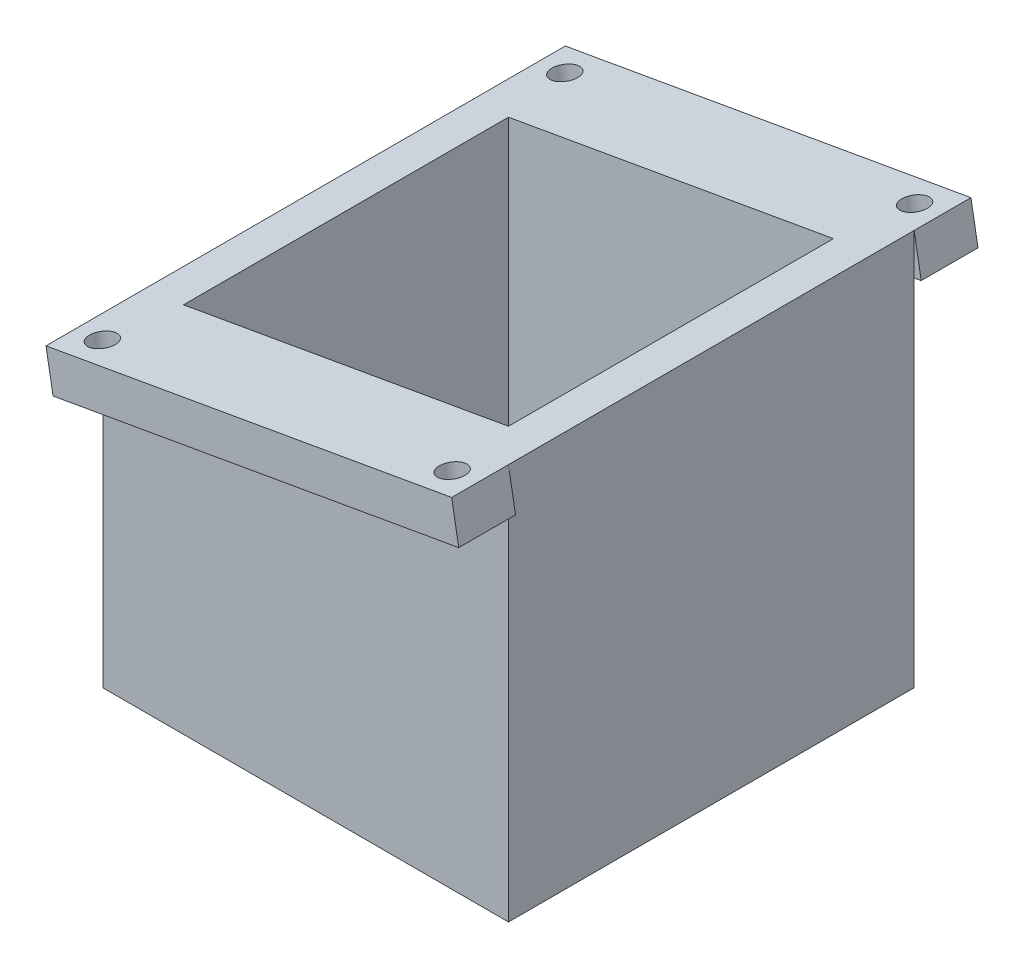
ISO-10303-21;
HEADER;
FILE_DESCRIPTION(('STEP AP214'),'2;1');
FILE_NAME('part.step','',(''),(''),'','','');
FILE_SCHEMA(('AUTOMOTIVE_DESIGN { 1 0 10303 214 1 1 1 1 }'));
ENDSEC;
DATA;
#1=APPLICATION_CONTEXT('core data for automotive mechanical design processes');
#2=APPLICATION_PROTOCOL_DEFINITION('international standard','automotive_design',2000,#1);
#3=PRODUCT_CONTEXT('',#1,'mechanical');
#4=PRODUCT('Part','Part','',(#3));
#5=PRODUCT_RELATED_PRODUCT_CATEGORY('part','',(#4));
#6=PRODUCT_DEFINITION_FORMATION('','',#4);
#7=PRODUCT_DEFINITION_CONTEXT('part definition',#1,'design');
#8=PRODUCT_DEFINITION('design','',#6,#7);
#9=PRODUCT_DEFINITION_SHAPE('','',#8);
#10=(LENGTH_UNIT() NAMED_UNIT(*) SI_UNIT(.MILLI.,.METRE.));
#11=(NAMED_UNIT(*) PLANE_ANGLE_UNIT() SI_UNIT($,.RADIAN.));
#12=(NAMED_UNIT(*) SI_UNIT($,.STERADIAN.) SOLID_ANGLE_UNIT());
#13=UNCERTAINTY_MEASURE_WITH_UNIT(LENGTH_MEASURE(1.E-05),#10,'distance_accuracy_value','');
#14=(GEOMETRIC_REPRESENTATION_CONTEXT(3) GLOBAL_UNCERTAINTY_ASSIGNED_CONTEXT((#13)) GLOBAL_UNIT_ASSIGNED_CONTEXT((#10,
#11,#12)) REPRESENTATION_CONTEXT('',''));
#15=CARTESIAN_POINT('',(0.,0.,0.));
#16=DIRECTION('',(0.,0.,1.));
#17=DIRECTION('',(1.,0.,0.));
#18=AXIS2_PLACEMENT_3D('',#15,#16,#17);
#19=CARTESIAN_POINT('',(25.,5.,-25.));
#20=DIRECTION('',(0.,0.,1.));
#21=DIRECTION('',(1.,0.,0.));
#22=AXIS2_PLACEMENT_3D('',#19,#20,#21);
#23=PLANE('',#22);
#24=DIRECTION('',(-0.17364819609251,0.984807749763281,0.));
#25=VECTOR('',#24,1.);
#26=CARTESIAN_POINT('',(-24.1317590195375,35.0759612511836,-25.));
#27=LINE('',#26,#25);
#28=CARTESIAN_POINT('',(-24.1317590195375,35.0759612511836,-25.));
#29=VERTEX_POINT('',#28);
#30=CARTESIAN_POINT('',(-25.,40.,-25.));
#31=VERTEX_POINT('',#30);
#32=EDGE_CURVE('E300',#29,#31,#27,.T.);
#33=ORIENTED_EDGE('',*,*,#32,.F.);
#34=DIRECTION('',(0.984807749763281,0.17364819609251,0.));
#35=VECTOR('',#34,1.);
#36=CARTESIAN_POINT('',(-24.1317590195375,35.0759612511836,-25.));
#37=LINE('',#36,#35);
#38=CARTESIAN_POINT('',(25.,43.7392169238216,-25.));
#39=VERTEX_POINT('',#38);
#40=EDGE_CURVE('E291',#29,#39,#37,.T.);
#41=ORIENTED_EDGE('',*,*,#40,.T.);
#42=DIRECTION('',(0.,-1.,0.));
#43=VECTOR('',#42,1.);
#44=CARTESIAN_POINT('',(25.,5.,-25.));
#45=LINE('',#44,#43);
#46=CARTESIAN_POINT('',(25.,0.,-25.));
#47=VERTEX_POINT('',#46);
#48=EDGE_CURVE('E284',#39,#47,#45,.T.);
#49=ORIENTED_EDGE('',*,*,#48,.T.);
#50=DIRECTION('',(-1.,0.,0.));
#51=VECTOR('',#50,1.);
#52=CARTESIAN_POINT('',(25.,0.,-25.));
#53=LINE('',#52,#51);
#54=CARTESIAN_POINT('',(-25.,0.,-25.));
#55=VERTEX_POINT('',#54);
#56=EDGE_CURVE('E279',#47,#55,#53,.T.);
#57=ORIENTED_EDGE('',*,*,#56,.T.);
#58=DIRECTION('',(0.,-1.,0.));
#59=VECTOR('',#58,1.);
#60=CARTESIAN_POINT('',(-25.,5.,-25.));
#61=LINE('',#60,#59);
#62=EDGE_CURVE('E281',#31,#55,#61,.T.);
#63=ORIENTED_EDGE('',*,*,#62,.F.);
#64=EDGE_LOOP('',(#33,#41,#49,#57,#63));
#65=FACE_BOUND('',#64,.T.);
#66=ADVANCED_FACE('F38',(#65),#23,.F.);
#67=CARTESIAN_POINT('',(0.,5.,0.));
#68=DIRECTION('',(0.,-1.,0.));
#69=DIRECTION('',(0.,0.,-1.));
#70=AXIS2_PLACEMENT_3D('',#67,#68,#69);
#71=PLANE('',#70);
#72=DIRECTION('',(0.,0.,-1.));
#73=VECTOR('',#72,1.);
#74=CARTESIAN_POINT('',(20.025,5.,0.));
#75=LINE('',#74,#73);
#76=CARTESIAN_POINT('',(20.025,5.,20.025));
#77=VERTEX_POINT('',#76);
#78=CARTESIAN_POINT('',(20.025,5.,-20.025));
#79=VERTEX_POINT('',#78);
#80=EDGE_CURVE('E234',#77,#79,#75,.T.);
#81=ORIENTED_EDGE('',*,*,#80,.T.);
#82=DIRECTION('',(-1.,0.,0.));
#83=VECTOR('',#82,1.);
#84=CARTESIAN_POINT('',(0.,5.,-20.025));
#85=LINE('',#84,#83);
#86=CARTESIAN_POINT('',(-20.025,5.,-20.025));
#87=VERTEX_POINT('',#86);
#88=EDGE_CURVE('E237',#79,#87,#85,.T.);
#89=ORIENTED_EDGE('',*,*,#88,.T.);
#90=DIRECTION('',(0.,0.,1.));
#91=VECTOR('',#90,1.);
#92=CARTESIAN_POINT('',(-20.025,5.,0.));
#93=LINE('',#92,#91);
#94=CARTESIAN_POINT('',(-20.025,5.,20.025));
#95=VERTEX_POINT('',#94);
#96=EDGE_CURVE('E228',#87,#95,#93,.T.);
#97=ORIENTED_EDGE('',*,*,#96,.T.);
#98=DIRECTION('',(1.,0.,0.));
#99=VECTOR('',#98,1.);
#100=CARTESIAN_POINT('',(0.,5.,20.025));
#101=LINE('',#100,#99);
#102=EDGE_CURVE('E231',#95,#77,#101,.T.);
#103=ORIENTED_EDGE('',*,*,#102,.T.);
#104=EDGE_LOOP('',(#81,#89,#97,#103));
#105=FACE_BOUND('',#104,.T.);
#106=DIRECTION('',(0.,0.,1.));
#107=VECTOR('',#106,1.);
#108=CARTESIAN_POINT('',(-18.025,5.,-18.025));
#109=LINE('',#108,#107);
#110=CARTESIAN_POINT('',(-18.025,5.,-18.025));
#111=VERTEX_POINT('',#110);
#112=CARTESIAN_POINT('',(-18.025,5.,18.025));
#113=VERTEX_POINT('',#112);
#114=EDGE_CURVE('E241',#111,#113,#109,.T.);
#115=ORIENTED_EDGE('',*,*,#114,.F.);
#116=DIRECTION('',(-1.,0.,0.));
#117=VECTOR('',#116,1.);
#118=CARTESIAN_POINT('',(18.025,5.,-18.025));
#119=LINE('',#118,#117);
#120=CARTESIAN_POINT('',(18.025,5.,-18.025));
#121=VERTEX_POINT('',#120);
#122=EDGE_CURVE('E249',#121,#111,#119,.T.);
#123=ORIENTED_EDGE('',*,*,#122,.F.);
#124=DIRECTION('',(0.,0.,-1.));
#125=VECTOR('',#124,1.);
#126=CARTESIAN_POINT('',(18.025,5.,-18.025));
#127=LINE('',#126,#125);
#128=CARTESIAN_POINT('',(18.025,5.,18.025));
#129=VERTEX_POINT('',#128);
#130=EDGE_CURVE('E246',#129,#121,#127,.T.);
#131=ORIENTED_EDGE('',*,*,#130,.F.);
#132=DIRECTION('',(1.,0.,0.));
#133=VECTOR('',#132,1.);
#134=CARTESIAN_POINT('',(18.025,5.,18.025));
#135=LINE('',#134,#133);
#136=EDGE_CURVE('E243',#113,#129,#135,.T.);
#137=ORIENTED_EDGE('',*,*,#136,.F.);
#138=EDGE_LOOP('',(#115,#123,#131,#137));
#139=FACE_BOUND('',#138,.T.);
#140=ADVANCED_FACE('F331',(#105,#139),#71,.F.);
#141=CARTESIAN_POINT('',(0.,0.,0.));
#142=DIRECTION('',(0.,-1.,0.));
#143=DIRECTION('',(0.,0.,-1.));
#144=AXIS2_PLACEMENT_3D('',#141,#142,#143);
#145=PLANE('',#144);
#146=DIRECTION('',(-1.,0.,0.));
#147=VECTOR('',#146,1.);
#148=CARTESIAN_POINT('',(18.025,0.,-18.025));
#149=LINE('',#148,#147);
#150=CARTESIAN_POINT('',(18.025,0.,-18.025));
#151=VERTEX_POINT('',#150);
#152=CARTESIAN_POINT('',(-18.025,0.,-18.025));
#153=VERTEX_POINT('',#152);
#154=EDGE_CURVE('E244',#151,#153,#149,.T.);
#155=ORIENTED_EDGE('',*,*,#154,.T.);
#156=DIRECTION('',(0.,0.,1.));
#157=VECTOR('',#156,1.);
#158=CARTESIAN_POINT('',(-18.025,0.,-18.025));
#159=LINE('',#158,#157);
#160=CARTESIAN_POINT('',(-18.025,0.,18.025));
#161=VERTEX_POINT('',#160);
#162=EDGE_CURVE('E240',#153,#161,#159,.T.);
#163=ORIENTED_EDGE('',*,*,#162,.T.);
#164=DIRECTION('',(1.,0.,0.));
#165=VECTOR('',#164,1.);
#166=CARTESIAN_POINT('',(18.025,0.,18.025));
#167=LINE('',#166,#165);
#168=CARTESIAN_POINT('',(18.025,0.,18.025));
#169=VERTEX_POINT('',#168);
#170=EDGE_CURVE('E254',#161,#169,#167,.T.);
#171=ORIENTED_EDGE('',*,*,#170,.T.);
#172=DIRECTION('',(0.,0.,-1.));
#173=VECTOR('',#172,1.);
#174=CARTESIAN_POINT('',(18.025,0.,-18.025));
#175=LINE('',#174,#173);
#176=EDGE_CURVE('E257',#169,#151,#175,.T.);
#177=ORIENTED_EDGE('',*,*,#176,.T.);
#178=EDGE_LOOP('',(#155,#163,#171,#177));
#179=FACE_BOUND('',#178,.T.);
#180=DIRECTION('',(0.,0.,1.));
#181=VECTOR('',#180,1.);
#182=CARTESIAN_POINT('',(-25.,0.,-25.));
#183=LINE('',#182,#181);
#184=CARTESIAN_POINT('',(-25.,0.,25.));
#185=VERTEX_POINT('',#184);
#186=EDGE_CURVE('E271',#55,#185,#183,.T.);
#187=ORIENTED_EDGE('',*,*,#186,.F.);
#188=ORIENTED_EDGE('',*,*,#56,.F.);
#189=DIRECTION('',(0.,0.,-1.));
#190=VECTOR('',#189,1.);
#191=CARTESIAN_POINT('',(25.,0.,-25.));
#192=LINE('',#191,#190);
#193=CARTESIAN_POINT('',(25.,0.,25.));
#194=VERTEX_POINT('',#193);
#195=EDGE_CURVE('E277',#194,#47,#192,.T.);
#196=ORIENTED_EDGE('',*,*,#195,.F.);
#197=DIRECTION('',(1.,0.,0.));
#198=VECTOR('',#197,1.);
#199=CARTESIAN_POINT('',(25.,0.,25.));
#200=LINE('',#199,#198);
#201=EDGE_CURVE('E274',#185,#194,#200,.T.);
#202=ORIENTED_EDGE('',*,*,#201,.F.);
#203=EDGE_LOOP('',(#187,#188,#196,#202));
#204=FACE_BOUND('',#203,.T.);
#205=ADVANCED_FACE('F295',(#179,#204),#145,.T.);
#206=CARTESIAN_POINT('',(-25.,5.,-25.));
#207=DIRECTION('',(1.,0.,0.));
#208=DIRECTION('',(0.,0.,-1.));
#209=AXIS2_PLACEMENT_3D('',#206,#207,#208);
#210=PLANE('',#209);
#211=ORIENTED_EDGE('',*,*,#186,.T.);
#212=DIRECTION('',(0.,-1.,0.));
#213=VECTOR('',#212,1.);
#214=CARTESIAN_POINT('',(-25.,5.,25.));
#215=LINE('',#214,#213);
#216=CARTESIAN_POINT('',(-25.,40.,25.));
#217=VERTEX_POINT('',#216);
#218=EDGE_CURVE('E42',#217,#185,#215,.T.);
#219=ORIENTED_EDGE('',*,*,#218,.F.);
#220=DIRECTION('',(0.,0.,1.));
#221=VECTOR('',#220,1.);
#222=CARTESIAN_POINT('',(-25.,40.,25.));
#223=LINE('',#222,#221);
#224=EDGE_CURVE('E210',#31,#217,#223,.T.);
#225=ORIENTED_EDGE('',*,*,#224,.F.);
#226=ORIENTED_EDGE('',*,*,#62,.T.);
#227=EDGE_LOOP('',(#211,#219,#225,#226));
#228=FACE_BOUND('',#227,.T.);
#229=ADVANCED_FACE('F40',(#228),#210,.F.);
#230=CARTESIAN_POINT('',(25.,5.,25.));
#231=DIRECTION('',(0.,0.,-1.));
#232=DIRECTION('',(-1.,0.,0.));
#233=AXIS2_PLACEMENT_3D('',#230,#231,#232);
#234=PLANE('',#233);
#235=DIRECTION('',(0.,-1.,0.));
#236=VECTOR('',#235,1.);
#237=CARTESIAN_POINT('',(25.,5.,25.));
#238=LINE('',#237,#236);
#239=CARTESIAN_POINT('',(25.,43.7392169238216,25.));
#240=VERTEX_POINT('',#239);
#241=EDGE_CURVE('E179',#240,#194,#238,.T.);
#242=ORIENTED_EDGE('',*,*,#241,.F.);
#243=DIRECTION('',(-0.984807749763281,-0.17364819609251,0.));
#244=VECTOR('',#243,1.);
#245=CARTESIAN_POINT('',(-24.1317590195375,35.0759612511836,25.));
#246=LINE('',#245,#244);
#247=CARTESIAN_POINT('',(-24.1317590195375,35.0759612511836,25.));
#248=VERTEX_POINT('',#247);
#249=EDGE_CURVE('E11',#240,#248,#246,.T.);
#250=ORIENTED_EDGE('',*,*,#249,.T.);
#251=DIRECTION('',(-0.17364819609251,0.984807749763281,0.));
#252=VECTOR('',#251,1.);
#253=CARTESIAN_POINT('',(-24.1317590195375,35.0759612511836,25.));
#254=LINE('',#253,#252);
#255=EDGE_CURVE('E361',#248,#217,#254,.T.);
#256=ORIENTED_EDGE('',*,*,#255,.T.);
#257=ORIENTED_EDGE('',*,*,#218,.T.);
#258=ORIENTED_EDGE('',*,*,#201,.T.);
#259=EDGE_LOOP('',(#242,#250,#256,#257,#258));
#260=FACE_BOUND('',#259,.T.);
#261=ADVANCED_FACE('F354',(#260),#234,.F.);
#262=CARTESIAN_POINT('',(25.,5.,-25.));
#263=DIRECTION('',(-1.,0.,0.));
#264=DIRECTION('',(0.,0.,1.));
#265=AXIS2_PLACEMENT_3D('',#262,#263,#264);
#266=PLANE('',#265);
#267=ORIENTED_EDGE('',*,*,#195,.T.);
#268=ORIENTED_EDGE('',*,*,#48,.F.);
#269=CARTESIAN_POINT('',(25.,48.81635,-25.));
#270=VERTEX_POINT('',#269);
#271=EDGE_CURVE('E205',#270,#39,#45,.T.);
#272=ORIENTED_EDGE('',*,*,#271,.F.);
#273=DIRECTION('',(0.,0.,-1.));
#274=VECTOR('',#273,1.);
#275=CARTESIAN_POINT('',(25.,48.81635,25.));
#276=LINE('',#275,#274);
#277=CARTESIAN_POINT('',(25.,48.81635,25.));
#278=VERTEX_POINT('',#277);
#279=EDGE_CURVE('E196',#278,#270,#276,.T.);
#280=ORIENTED_EDGE('',*,*,#279,.F.);
#281=EDGE_CURVE('E171',#278,#240,#238,.T.);
#282=ORIENTED_EDGE('',*,*,#281,.T.);
#283=ORIENTED_EDGE('',*,*,#241,.T.);
#284=EDGE_LOOP('',(#267,#268,#272,#280,#282,#283));
#285=FACE_BOUND('',#284,.T.);
#286=ADVANCED_FACE('F203',(#285),#266,.F.);
#287=CARTESIAN_POINT('',(-18.025,5.,-18.025));
#288=DIRECTION('',(1.,0.,0.));
#289=DIRECTION('',(0.,0.,-1.));
#290=AXIS2_PLACEMENT_3D('',#287,#288,#289);
#291=PLANE('',#290);
#292=ORIENTED_EDGE('',*,*,#162,.F.);
#293=DIRECTION('',(0.,-1.,0.));
#294=VECTOR('',#293,1.);
#295=CARTESIAN_POINT('',(-18.025,5.,-18.025));
#296=LINE('',#295,#294);
#297=EDGE_CURVE('E251',#111,#153,#296,.T.);
#298=ORIENTED_EDGE('',*,*,#297,.F.);
#299=ORIENTED_EDGE('',*,*,#114,.T.);
#300=DIRECTION('',(0.,-1.,0.));
#301=VECTOR('',#300,1.);
#302=CARTESIAN_POINT('',(-18.025,5.,18.025));
#303=LINE('',#302,#301);
#304=EDGE_CURVE('E268',#113,#161,#303,.T.);
#305=ORIENTED_EDGE('',*,*,#304,.T.);
#306=EDGE_LOOP('',(#292,#298,#299,#305));
#307=FACE_BOUND('',#306,.T.);
#308=ADVANCED_FACE('F353',(#307),#291,.T.);
#309=CARTESIAN_POINT('',(18.025,5.,18.025));
#310=DIRECTION('',(0.,0.,-1.));
#311=DIRECTION('',(-1.,0.,0.));
#312=AXIS2_PLACEMENT_3D('',#309,#310,#311);
#313=PLANE('',#312);
#314=ORIENTED_EDGE('',*,*,#170,.F.);
#315=ORIENTED_EDGE('',*,*,#304,.F.);
#316=ORIENTED_EDGE('',*,*,#136,.T.);
#317=DIRECTION('',(0.,-1.,0.));
#318=VECTOR('',#317,1.);
#319=CARTESIAN_POINT('',(18.025,5.,18.025));
#320=LINE('',#319,#318);
#321=EDGE_CURVE('E266',#129,#169,#320,.T.);
#322=ORIENTED_EDGE('',*,*,#321,.T.);
#323=EDGE_LOOP('',(#314,#315,#316,#322));
#324=FACE_BOUND('',#323,.T.);
#325=ADVANCED_FACE('F643',(#324),#313,.T.);
#326=CARTESIAN_POINT('',(18.025,5.,-18.025));
#327=DIRECTION('',(-1.,0.,0.));
#328=DIRECTION('',(0.,0.,1.));
#329=AXIS2_PLACEMENT_3D('',#326,#327,#328);
#330=PLANE('',#329);
#331=ORIENTED_EDGE('',*,*,#176,.F.);
#332=ORIENTED_EDGE('',*,*,#321,.F.);
#333=ORIENTED_EDGE('',*,*,#130,.T.);
#334=DIRECTION('',(0.,-1.,0.));
#335=VECTOR('',#334,1.);
#336=CARTESIAN_POINT('',(18.025,5.,-18.025));
#337=LINE('',#336,#335);
#338=EDGE_CURVE('E264',#121,#151,#337,.T.);
#339=ORIENTED_EDGE('',*,*,#338,.T.);
#340=EDGE_LOOP('',(#331,#332,#333,#339));
#341=FACE_BOUND('',#340,.T.);
#342=ADVANCED_FACE('F632',(#341),#330,.T.);
#343=CARTESIAN_POINT('',(18.025,5.,-18.025));
#344=DIRECTION('',(0.,0.,1.));
#345=DIRECTION('',(1.,0.,0.));
#346=AXIS2_PLACEMENT_3D('',#343,#344,#345);
#347=PLANE('',#346);
#348=ORIENTED_EDGE('',*,*,#154,.F.);
#349=ORIENTED_EDGE('',*,*,#338,.F.);
#350=ORIENTED_EDGE('',*,*,#122,.T.);
#351=ORIENTED_EDGE('',*,*,#297,.T.);
#352=EDGE_LOOP('',(#348,#349,#350,#351));
#353=FACE_BOUND('',#352,.T.);
#354=ADVANCED_FACE('F342',(#353),#347,.T.);
#355=CARTESIAN_POINT('',(20.025,110.710678118655,-20.025));
#356=DIRECTION('',(0.,0.,1.));
#357=DIRECTION('',(1.,0.,0.));
#358=AXIS2_PLACEMENT_3D('',#355,#356,#357);
#359=PLANE('',#358);
#360=ORIENTED_EDGE('',*,*,#88,.F.);
#361=DIRECTION('',(0.,-1.,0.));
#362=VECTOR('',#361,1.);
#363=CARTESIAN_POINT('',(20.025,110.710678118655,-20.025));
#364=LINE('',#363,#362);
#365=CARTESIAN_POINT('',(20.025,47.939123175,-20.025));
#366=VERTEX_POINT('',#365);
#367=EDGE_CURVE('E221',#366,#79,#364,.T.);
#368=ORIENTED_EDGE('',*,*,#367,.F.);
#369=DIRECTION('',(-0.984807749763281,-0.17364819609251,0.));
#370=VECTOR('',#369,1.);
#371=CARTESIAN_POINT('',(31.6066827751661,49.9812865536967,-20.025));
#372=LINE('',#371,#370);
#373=CARTESIAN_POINT('',(-20.025,40.877226825,-20.025));
#374=VERTEX_POINT('',#373);
#375=EDGE_CURVE('E206',#366,#374,#372,.T.);
#376=ORIENTED_EDGE('',*,*,#375,.T.);
#377=DIRECTION('',(0.,-1.,0.));
#378=VECTOR('',#377,1.);
#379=CARTESIAN_POINT('',(-20.025,110.710678118655,-20.025));
#380=LINE('',#379,#378);
#381=EDGE_CURVE('E218',#374,#87,#380,.T.);
#382=ORIENTED_EDGE('',*,*,#381,.T.);
#383=EDGE_LOOP('',(#360,#368,#376,#382));
#384=FACE_BOUND('',#383,.T.);
#385=ADVANCED_FACE('F329',(#384),#359,.T.);
#386=CARTESIAN_POINT('',(20.025,110.710678118655,20.025));
#387=DIRECTION('',(-1.,0.,0.));
#388=DIRECTION('',(0.,0.,1.));
#389=AXIS2_PLACEMENT_3D('',#386,#387,#388);
#390=PLANE('',#389);
#391=ORIENTED_EDGE('',*,*,#80,.F.);
#392=DIRECTION('',(0.,-1.,0.));
#393=VECTOR('',#392,1.);
#394=CARTESIAN_POINT('',(20.025,110.710678118655,20.025));
#395=LINE('',#394,#393);
#396=CARTESIAN_POINT('',(20.025,47.939123175,20.025));
#397=VERTEX_POINT('',#396);
#398=EDGE_CURVE('E224',#397,#77,#395,.T.);
#399=ORIENTED_EDGE('',*,*,#398,.F.);
#400=DIRECTION('',(0.,0.,-1.));
#401=VECTOR('',#400,1.);
#402=CARTESIAN_POINT('',(20.025,47.939123175,20.025));
#403=LINE('',#402,#401);
#404=EDGE_CURVE('E305',#397,#366,#403,.T.);
#405=ORIENTED_EDGE('',*,*,#404,.T.);
#406=ORIENTED_EDGE('',*,*,#367,.T.);
#407=EDGE_LOOP('',(#391,#399,#405,#406));
#408=FACE_BOUND('',#407,.T.);
#409=ADVANCED_FACE('F334',(#408),#390,.T.);
#410=CARTESIAN_POINT('',(20.025,110.710678118655,20.025));
#411=DIRECTION('',(0.,0.,-1.));
#412=DIRECTION('',(-1.,0.,0.));
#413=AXIS2_PLACEMENT_3D('',#410,#411,#412);
#414=PLANE('',#413);
#415=ORIENTED_EDGE('',*,*,#102,.F.);
#416=DIRECTION('',(0.,-1.,0.));
#417=VECTOR('',#416,1.);
#418=CARTESIAN_POINT('',(-20.025,110.710678118655,20.025));
#419=LINE('',#418,#417);
#420=CARTESIAN_POINT('',(-20.025,40.877226825,20.025));
#421=VERTEX_POINT('',#420);
#422=EDGE_CURVE('E63',#421,#95,#419,.T.);
#423=ORIENTED_EDGE('',*,*,#422,.F.);
#424=DIRECTION('',(0.984807749763281,0.17364819609251,0.));
#425=VECTOR('',#424,1.);
#426=CARTESIAN_POINT('',(31.6066827751661,49.9812865536967,20.025));
#427=LINE('',#426,#425);
#428=EDGE_CURVE('E212',#421,#397,#427,.T.);
#429=ORIENTED_EDGE('',*,*,#428,.T.);
#430=ORIENTED_EDGE('',*,*,#398,.T.);
#431=EDGE_LOOP('',(#415,#423,#429,#430));
#432=FACE_BOUND('',#431,.T.);
#433=ADVANCED_FACE('F322',(#432),#414,.T.);
#434=CARTESIAN_POINT('',(-20.025,110.710678118655,20.025));
#435=DIRECTION('',(1.,0.,0.));
#436=DIRECTION('',(0.,0.,-1.));
#437=AXIS2_PLACEMENT_3D('',#434,#435,#436);
#438=PLANE('',#437);
#439=ORIENTED_EDGE('',*,*,#96,.F.);
#440=ORIENTED_EDGE('',*,*,#381,.F.);
#441=DIRECTION('',(0.,0.,1.));
#442=VECTOR('',#441,1.);
#443=CARTESIAN_POINT('',(-20.025,40.877226825,20.025));
#444=LINE('',#443,#442);
#445=EDGE_CURVE('E207',#374,#421,#444,.T.);
#446=ORIENTED_EDGE('',*,*,#445,.T.);
#447=ORIENTED_EDGE('',*,*,#422,.T.);
#448=EDGE_LOOP('',(#439,#440,#446,#447));
#449=FACE_BOUND('',#448,.T.);
#450=ADVANCED_FACE('F327',(#449),#438,.T.);
#451=CARTESIAN_POINT('',(-7.59424596992729,43.0691043908606,0.));
#452=DIRECTION('',(-0.17364819609251,0.984807749763281,0.));
#453=DIRECTION('',(-0.984807749763281,-0.17364819609251,0.));
#454=AXIS2_PLACEMENT_3D('',#451,#452,#453);
#455=PLANE('',#454);
#456=CARTESIAN_POINT('',(-21.5531728758285,40.6077686863238,-28.5));
#457=DIRECTION('',(-0.17364819609251,0.984807749763281,0.));
#458=DIRECTION('',(0.984807749763281,0.17364819609251,0.));
#459=AXIS2_PLACEMENT_3D('',#456,#457,#458);
#460=CIRCLE('',#459,1.60000000000001);
#461=CARTESIAN_POINT('',(-19.9774804762073,40.8856058000718,-28.5));
#462=VERTEX_POINT('',#461);
#463=EDGE_CURVE('E427',#462,#462,#460,.T.);
#464=ORIENTED_EDGE('',*,*,#463,.F.);
#465=EDGE_LOOP('',(#464));
#466=FACE_BOUND('',#465,.T.);
#467=CARTESIAN_POINT('',(21.5531728758285,48.2085813136762,-28.5));
#468=DIRECTION('',(-0.17364819609251,0.984807749763281,0.));
#469=DIRECTION('',(-0.984807749763281,-0.17364819609251,0.));
#470=AXIS2_PLACEMENT_3D('',#467,#468,#469);
#471=CIRCLE('',#470,1.6);
#472=CARTESIAN_POINT('',(19.9774804762073,47.9307441999282,-28.5));
#473=VERTEX_POINT('',#472);
#474=EDGE_CURVE('E431',#473,#473,#471,.T.);
#475=ORIENTED_EDGE('',*,*,#474,.F.);
#476=EDGE_LOOP('',(#475));
#477=FACE_BOUND('',#476,.T.);
#478=CARTESIAN_POINT('',(21.5531728758285,48.2085813136762,28.5));
#479=DIRECTION('',(-0.17364819609251,0.984807749763281,0.));
#480=DIRECTION('',(0.984807749763281,0.17364819609251,0.));
#481=AXIS2_PLACEMENT_3D('',#478,#479,#480);
#482=CIRCLE('',#481,1.6);
#483=CARTESIAN_POINT('',(23.1288652754497,48.4864184274242,28.5));
#484=VERTEX_POINT('',#483);
#485=EDGE_CURVE('E435',#484,#484,#482,.T.);
#486=ORIENTED_EDGE('',*,*,#485,.F.);
#487=EDGE_LOOP('',(#486));
#488=FACE_BOUND('',#487,.T.);
#489=CARTESIAN_POINT('',(-21.5531728758285,40.6077686863238,28.5));
#490=DIRECTION('',(-0.17364819609251,0.984807749763281,0.));
#491=DIRECTION('',(-0.984807749763281,-0.17364819609251,0.));
#492=AXIS2_PLACEMENT_3D('',#489,#490,#491);
#493=CIRCLE('',#492,1.60000000000001);
#494=CARTESIAN_POINT('',(-23.1288652754498,40.3299315725758,28.5));
#495=VERTEX_POINT('',#494);
#496=EDGE_CURVE('E371',#495,#495,#493,.T.);
#497=ORIENTED_EDGE('',*,*,#496,.F.);
#498=EDGE_LOOP('',(#497));
#499=FACE_BOUND('',#498,.T.);
#500=ORIENTED_EDGE('',*,*,#445,.F.);
#501=ORIENTED_EDGE('',*,*,#375,.F.);
#502=ORIENTED_EDGE('',*,*,#404,.F.);
#503=ORIENTED_EDGE('',*,*,#428,.F.);
#504=EDGE_LOOP('',(#500,#501,#502,#503));
#505=FACE_BOUND('',#504,.T.);
#506=ORIENTED_EDGE('',*,*,#279,.T.);
#507=DIRECTION('',(0.,0.,-1.));
#508=VECTOR('',#507,1.);
#509=CARTESIAN_POINT('',(25.,48.81635,-25.));
#510=LINE('',#509,#508);
#511=CARTESIAN_POINT('',(25.,48.81635,-32.));
#512=VERTEX_POINT('',#511);
#513=EDGE_CURVE('E377',#270,#512,#510,.T.);
#514=ORIENTED_EDGE('',*,*,#513,.T.);
#515=DIRECTION('',(-0.984807749763281,-0.17364819609251,0.));
#516=VECTOR('',#515,1.);
#517=CARTESIAN_POINT('',(-25.,40.,-32.));
#518=LINE('',#517,#516);
#519=CARTESIAN_POINT('',(-25.,40.,-32.));
#520=VERTEX_POINT('',#519);
#521=EDGE_CURVE('E391',#512,#520,#518,.T.);
#522=ORIENTED_EDGE('',*,*,#521,.T.);
#523=DIRECTION('',(0.,0.,1.));
#524=VECTOR('',#523,1.);
#525=CARTESIAN_POINT('',(-25.,40.,-25.));
#526=LINE('',#525,#524);
#527=EDGE_CURVE('E313',#520,#31,#526,.T.);
#528=ORIENTED_EDGE('',*,*,#527,.T.);
#529=ORIENTED_EDGE('',*,*,#224,.T.);
#530=DIRECTION('',(0.,0.,1.));
#531=VECTOR('',#530,1.);
#532=CARTESIAN_POINT('',(-25.,40.,25.));
#533=LINE('',#532,#531);
#534=CARTESIAN_POINT('',(-25.,40.,32.));
#535=VERTEX_POINT('',#534);
#536=EDGE_CURVE('E376',#217,#535,#533,.T.);
#537=ORIENTED_EDGE('',*,*,#536,.T.);
#538=DIRECTION('',(0.984807749763281,0.17364819609251,0.));
#539=VECTOR('',#538,1.);
#540=CARTESIAN_POINT('',(-25.,40.,32.));
#541=LINE('',#540,#539);
#542=CARTESIAN_POINT('',(25.,48.81635,32.));
#543=VERTEX_POINT('',#542);
#544=EDGE_CURVE('E199',#535,#543,#541,.T.);
#545=ORIENTED_EDGE('',*,*,#544,.T.);
#546=DIRECTION('',(0.,0.,-1.));
#547=VECTOR('',#546,1.);
#548=CARTESIAN_POINT('',(25.,48.81635,25.));
#549=LINE('',#548,#547);
#550=EDGE_CURVE('E185',#543,#278,#549,.T.);
#551=ORIENTED_EDGE('',*,*,#550,.T.);
#552=EDGE_LOOP('',(#506,#514,#522,#528,#529,#537,#545,#551));
#553=FACE_BOUND('',#552,.T.);
#554=ADVANCED_FACE('F194',(#466,#477,#488,#499,#505,#553),#455,.T.);
#555=CARTESIAN_POINT('',(-24.1317590195375,35.0759612511836,-25.));
#556=DIRECTION('',(0.,0.,1.));
#557=DIRECTION('',(1.,0.,0.));
#558=AXIS2_PLACEMENT_3D('',#555,#556,#557);
#559=PLANE('',#558);
#560=DIRECTION('',(-0.17364819609251,0.984807749763281,0.));
#561=VECTOR('',#560,1.);
#562=CARTESIAN_POINT('',(25.8682409804625,43.8923112511836,-25.));
#563=LINE('',#562,#561);
#564=CARTESIAN_POINT('',(25.8682409804625,43.8923112511836,-25.));
#565=VERTEX_POINT('',#564);
#566=EDGE_CURVE('E317',#565,#270,#563,.T.);
#567=ORIENTED_EDGE('',*,*,#566,.T.);
#568=ORIENTED_EDGE('',*,*,#271,.T.);
#569=EDGE_CURVE('E55',#39,#565,#37,.T.);
#570=ORIENTED_EDGE('',*,*,#569,.T.);
#571=EDGE_LOOP('',(#567,#568,#570));
#572=FACE_BOUND('',#571,.T.);
#573=ADVANCED_FACE('F395',(#572),#559,.T.);
#574=CARTESIAN_POINT('',(-24.1317590195375,35.0759612511836,-25.));
#575=DIRECTION('',(-0.984807749763281,-0.17364819609251,0.));
#576=DIRECTION('',(0.17364819609251,-0.984807749763281,0.));
#577=AXIS2_PLACEMENT_3D('',#574,#575,#576);
#578=PLANE('',#577);
#579=ORIENTED_EDGE('',*,*,#527,.F.);
#580=DIRECTION('',(-0.17364819609251,0.984807749763281,0.));
#581=VECTOR('',#580,1.);
#582=CARTESIAN_POINT('',(-24.1317590195375,35.0759612511836,-32.));
#583=LINE('',#582,#581);
#584=CARTESIAN_POINT('',(-24.1317590195375,35.0759612511836,-32.));
#585=VERTEX_POINT('',#584);
#586=EDGE_CURVE('E306',#585,#520,#583,.T.);
#587=ORIENTED_EDGE('',*,*,#586,.F.);
#588=DIRECTION('',(0.,0.,1.));
#589=VECTOR('',#588,1.);
#590=CARTESIAN_POINT('',(-24.1317590195375,35.0759612511836,-25.));
#591=LINE('',#590,#589);
#592=EDGE_CURVE('E318',#585,#29,#591,.T.);
#593=ORIENTED_EDGE('',*,*,#592,.T.);
#594=ORIENTED_EDGE('',*,*,#32,.T.);
#595=EDGE_LOOP('',(#579,#587,#593,#594));
#596=FACE_BOUND('',#595,.T.);
#597=ADVANCED_FACE('F404',(#596),#578,.T.);
#598=CARTESIAN_POINT('',(-24.1317590195375,35.0759612511836,-32.));
#599=DIRECTION('',(0.,0.,-1.));
#600=DIRECTION('',(0.,1.,0.));
#601=AXIS2_PLACEMENT_3D('',#598,#599,#600);
#602=PLANE('',#601);
#603=ORIENTED_EDGE('',*,*,#521,.F.);
#604=DIRECTION('',(-0.17364819609251,0.984807749763281,0.));
#605=VECTOR('',#604,1.);
#606=CARTESIAN_POINT('',(25.8682409804625,43.8923112511836,-32.));
#607=LINE('',#606,#605);
#608=CARTESIAN_POINT('',(25.8682409804625,43.8923112511836,-32.));
#609=VERTEX_POINT('',#608);
#610=EDGE_CURVE('E310',#609,#512,#607,.T.);
#611=ORIENTED_EDGE('',*,*,#610,.F.);
#612=DIRECTION('',(-0.984807749763281,-0.17364819609251,0.));
#613=VECTOR('',#612,1.);
#614=CARTESIAN_POINT('',(-24.1317590195375,35.0759612511836,-32.));
#615=LINE('',#614,#613);
#616=EDGE_CURVE('E387',#609,#585,#615,.T.);
#617=ORIENTED_EDGE('',*,*,#616,.T.);
#618=ORIENTED_EDGE('',*,*,#586,.T.);
#619=EDGE_LOOP('',(#603,#611,#617,#618));
#620=FACE_BOUND('',#619,.T.);
#621=ADVANCED_FACE('F403',(#620),#602,.T.);
#622=CARTESIAN_POINT('',(25.8682409804625,43.8923112511836,-25.));
#623=DIRECTION('',(0.984807749763281,0.17364819609251,0.));
#624=DIRECTION('',(-0.17364819609251,0.984807749763281,0.));
#625=AXIS2_PLACEMENT_3D('',#622,#623,#624);
#626=PLANE('',#625);
#627=ORIENTED_EDGE('',*,*,#513,.F.);
#628=ORIENTED_EDGE('',*,*,#566,.F.);
#629=DIRECTION('',(0.,0.,-1.));
#630=VECTOR('',#629,1.);
#631=CARTESIAN_POINT('',(25.8682409804625,43.8923112511836,-25.));
#632=LINE('',#631,#630);
#633=EDGE_CURVE('E384',#565,#609,#632,.T.);
#634=ORIENTED_EDGE('',*,*,#633,.T.);
#635=ORIENTED_EDGE('',*,*,#610,.T.);
#636=EDGE_LOOP('',(#627,#628,#634,#635));
#637=FACE_BOUND('',#636,.T.);
#638=ADVANCED_FACE('F398',(#637),#626,.T.);
#639=CARTESIAN_POINT('',(-6.72600498946473,38.1450656420443,0.));
#640=DIRECTION('',(-0.17364819609251,0.984807749763281,0.));
#641=DIRECTION('',(-0.984807749763281,-0.17364819609251,0.));
#642=AXIS2_PLACEMENT_3D('',#639,#640,#641);
#643=PLANE('',#642);
#644=CARTESIAN_POINT('',(-20.684931895366,35.6837299375074,-28.5));
#645=DIRECTION('',(-0.17364819609251,0.984807749763281,0.));
#646=DIRECTION('',(0.984807749763281,0.17364819609251,0.));
#647=AXIS2_PLACEMENT_3D('',#644,#645,#646);
#648=CIRCLE('',#647,1.60000000000001);
#649=CARTESIAN_POINT('',(-19.1092394957447,35.9615670512554,-28.5));
#650=VERTEX_POINT('',#649);
#651=EDGE_CURVE('E451',#650,#650,#648,.T.);
#652=ORIENTED_EDGE('',*,*,#651,.T.);
#653=EDGE_LOOP('',(#652));
#654=FACE_BOUND('',#653,.T.);
#655=CARTESIAN_POINT('',(22.421413856291,43.2845425648598,-28.5));
#656=DIRECTION('',(-0.17364819609251,0.984807749763281,0.));
#657=DIRECTION('',(-0.984807749763281,-0.17364819609251,0.));
#658=AXIS2_PLACEMENT_3D('',#655,#656,#657);
#659=CIRCLE('',#658,1.6);
#660=CARTESIAN_POINT('',(20.8457214566698,43.0067054511118,-28.5));
#661=VERTEX_POINT('',#660);
#662=EDGE_CURVE('E447',#661,#661,#659,.T.);
#663=ORIENTED_EDGE('',*,*,#662,.T.);
#664=EDGE_LOOP('',(#663));
#665=FACE_BOUND('',#664,.T.);
#666=ORIENTED_EDGE('',*,*,#40,.F.);
#667=ORIENTED_EDGE('',*,*,#592,.F.);
#668=ORIENTED_EDGE('',*,*,#616,.F.);
#669=ORIENTED_EDGE('',*,*,#633,.F.);
#670=ORIENTED_EDGE('',*,*,#569,.F.);
#671=EDGE_LOOP('',(#666,#667,#668,#669,#670));
#672=FACE_BOUND('',#671,.T.);
#673=ADVANCED_FACE('F400',(#654,#665,#672),#643,.F.);
#674=CARTESIAN_POINT('',(-24.1317590195375,35.0759612511836,25.));
#675=DIRECTION('',(0.,0.,-1.));
#676=DIRECTION('',(0.,1.,0.));
#677=AXIS2_PLACEMENT_3D('',#674,#675,#676);
#678=PLANE('',#677);
#679=ORIENTED_EDGE('',*,*,#281,.F.);
#680=DIRECTION('',(-0.17364819609251,0.984807749763281,0.));
#681=VECTOR('',#680,1.);
#682=CARTESIAN_POINT('',(25.8682409804625,43.8923112511836,25.));
#683=LINE('',#682,#681);
#684=CARTESIAN_POINT('',(25.8682409804625,43.8923112511836,25.));
#685=VERTEX_POINT('',#684);
#686=EDGE_CURVE('E174',#685,#278,#683,.T.);
#687=ORIENTED_EDGE('',*,*,#686,.F.);
#688=EDGE_CURVE('E48',#685,#240,#246,.T.);
#689=ORIENTED_EDGE('',*,*,#688,.T.);
#690=EDGE_LOOP('',(#679,#687,#689));
#691=FACE_BOUND('',#690,.T.);
#692=ADVANCED_FACE('F173',(#691),#678,.T.);
#693=CARTESIAN_POINT('',(25.8682409804625,43.8923112511836,25.));
#694=DIRECTION('',(0.984807749763281,0.17364819609251,0.));
#695=DIRECTION('',(-0.17364819609251,0.984807749763281,0.));
#696=AXIS2_PLACEMENT_3D('',#693,#694,#695);
#697=PLANE('',#696);
#698=ORIENTED_EDGE('',*,*,#550,.F.);
#699=DIRECTION('',(-0.17364819609251,0.984807749763281,0.));
#700=VECTOR('',#699,1.);
#701=CARTESIAN_POINT('',(25.8682409804625,43.8923112511836,32.));
#702=LINE('',#701,#700);
#703=CARTESIAN_POINT('',(25.8682409804625,43.8923112511836,32.));
#704=VERTEX_POINT('',#703);
#705=EDGE_CURVE('E188',#704,#543,#702,.T.);
#706=ORIENTED_EDGE('',*,*,#705,.F.);
#707=DIRECTION('',(0.,0.,-1.));
#708=VECTOR('',#707,1.);
#709=CARTESIAN_POINT('',(25.8682409804625,43.8923112511836,25.));
#710=LINE('',#709,#708);
#711=EDGE_CURVE('E187',#704,#685,#710,.T.);
#712=ORIENTED_EDGE('',*,*,#711,.T.);
#713=ORIENTED_EDGE('',*,*,#686,.T.);
#714=EDGE_LOOP('',(#698,#706,#712,#713));
#715=FACE_BOUND('',#714,.T.);
#716=ADVANCED_FACE('F184',(#715),#697,.T.);
#717=CARTESIAN_POINT('',(-24.1317590195375,35.0759612511836,32.));
#718=DIRECTION('',(0.,0.,1.));
#719=DIRECTION('',(1.,0.,0.));
#720=AXIS2_PLACEMENT_3D('',#717,#718,#719);
#721=PLANE('',#720);
#722=ORIENTED_EDGE('',*,*,#544,.F.);
#723=DIRECTION('',(-0.17364819609251,0.984807749763281,0.));
#724=VECTOR('',#723,1.);
#725=CARTESIAN_POINT('',(-24.1317590195375,35.0759612511836,32.));
#726=LINE('',#725,#724);
#727=CARTESIAN_POINT('',(-24.1317590195375,35.0759612511836,32.));
#728=VERTEX_POINT('',#727);
#729=EDGE_CURVE('E365',#728,#535,#726,.T.);
#730=ORIENTED_EDGE('',*,*,#729,.F.);
#731=DIRECTION('',(0.984807749763281,0.17364819609251,0.));
#732=VECTOR('',#731,1.);
#733=CARTESIAN_POINT('',(-24.1317590195375,35.0759612511836,32.));
#734=LINE('',#733,#732);
#735=EDGE_CURVE('E367',#728,#704,#734,.T.);
#736=ORIENTED_EDGE('',*,*,#735,.T.);
#737=ORIENTED_EDGE('',*,*,#705,.T.);
#738=EDGE_LOOP('',(#722,#730,#736,#737));
#739=FACE_BOUND('',#738,.T.);
#740=ADVANCED_FACE('F480',(#739),#721,.T.);
#741=CARTESIAN_POINT('',(-24.1317590195375,35.0759612511836,25.));
#742=DIRECTION('',(-0.984807749763281,-0.17364819609251,0.));
#743=DIRECTION('',(0.17364819609251,-0.984807749763281,0.));
#744=AXIS2_PLACEMENT_3D('',#741,#742,#743);
#745=PLANE('',#744);
#746=ORIENTED_EDGE('',*,*,#536,.F.);
#747=ORIENTED_EDGE('',*,*,#255,.F.);
#748=DIRECTION('',(0.,0.,1.));
#749=VECTOR('',#748,1.);
#750=CARTESIAN_POINT('',(-24.1317590195375,35.0759612511836,25.));
#751=LINE('',#750,#749);
#752=EDGE_CURVE('E381',#248,#728,#751,.T.);
#753=ORIENTED_EDGE('',*,*,#752,.T.);
#754=ORIENTED_EDGE('',*,*,#729,.T.);
#755=EDGE_LOOP('',(#746,#747,#753,#754));
#756=FACE_BOUND('',#755,.T.);
#757=ADVANCED_FACE('F477',(#756),#745,.T.);
#758=CARTESIAN_POINT('',(-6.72600498946474,38.1450656420443,0.));
#759=DIRECTION('',(0.17364819609251,-0.984807749763281,0.));
#760=DIRECTION('',(0.984807749763281,0.17364819609251,0.));
#761=AXIS2_PLACEMENT_3D('',#758,#759,#760);
#762=PLANE('',#761);
#763=CARTESIAN_POINT('',(22.421413856291,43.2845425648598,28.5));
#764=DIRECTION('',(-0.17364819609251,0.984807749763281,0.));
#765=DIRECTION('',(0.984807749763281,0.17364819609251,0.));
#766=AXIS2_PLACEMENT_3D('',#763,#764,#765);
#767=CIRCLE('',#766,1.6);
#768=CARTESIAN_POINT('',(23.9971062559123,43.5623796786078,28.5));
#769=VERTEX_POINT('',#768);
#770=EDGE_CURVE('E440',#769,#769,#767,.T.);
#771=ORIENTED_EDGE('',*,*,#770,.T.);
#772=EDGE_LOOP('',(#771));
#773=FACE_BOUND('',#772,.T.);
#774=CARTESIAN_POINT('',(-20.684931895366,35.6837299375074,28.5));
#775=DIRECTION('',(-0.17364819609251,0.984807749763281,0.));
#776=DIRECTION('',(-0.984807749763281,-0.17364819609251,0.));
#777=AXIS2_PLACEMENT_3D('',#774,#775,#776);
#778=CIRCLE('',#777,1.60000000000001);
#779=CARTESIAN_POINT('',(-22.2606242949872,35.4058928237594,28.5));
#780=VERTEX_POINT('',#779);
#781=EDGE_CURVE('E189',#780,#780,#778,.T.);
#782=ORIENTED_EDGE('',*,*,#781,.T.);
#783=EDGE_LOOP('',(#782));
#784=FACE_BOUND('',#783,.T.);
#785=ORIENTED_EDGE('',*,*,#688,.F.);
#786=ORIENTED_EDGE('',*,*,#711,.F.);
#787=ORIENTED_EDGE('',*,*,#735,.F.);
#788=ORIENTED_EDGE('',*,*,#752,.F.);
#789=ORIENTED_EDGE('',*,*,#249,.F.);
#790=EDGE_LOOP('',(#785,#786,#787,#788,#789));
#791=FACE_BOUND('',#790,.T.);
#792=ADVANCED_FACE('F473',(#773,#784,#791),#762,.T.);
#793=CARTESIAN_POINT('',(-20.684931895366,35.6837299375074,28.5));
#794=DIRECTION('',(-0.17364819609251,0.984807749763281,0.));
#795=DIRECTION('',(-0.984807749763281,-0.17364819609251,0.));
#796=AXIS2_PLACEMENT_3D('',#793,#794,#795);
#797=CYLINDRICAL_SURFACE('',#796,1.60000000000001);
#798=ORIENTED_EDGE('',*,*,#781,.F.);
#799=EDGE_LOOP('',(#798));
#800=FACE_BOUND('',#799,.T.);
#801=ORIENTED_EDGE('',*,*,#496,.T.);
#802=EDGE_LOOP('',(#801));
#803=FACE_BOUND('',#802,.T.);
#804=ADVANCED_FACE('F470',(#800,#803),#797,.F.);
#805=CARTESIAN_POINT('',(22.421413856291,43.2845425648598,28.5));
#806=DIRECTION('',(-0.17364819609251,0.984807749763281,0.));
#807=DIRECTION('',(-0.984807749763281,-0.17364819609251,0.));
#808=AXIS2_PLACEMENT_3D('',#805,#806,#807);
#809=CYLINDRICAL_SURFACE('',#808,1.6);
#810=ORIENTED_EDGE('',*,*,#770,.F.);
#811=EDGE_LOOP('',(#810));
#812=FACE_BOUND('',#811,.T.);
#813=ORIENTED_EDGE('',*,*,#485,.T.);
#814=EDGE_LOOP('',(#813));
#815=FACE_BOUND('',#814,.T.);
#816=ADVANCED_FACE('F465',(#812,#815),#809,.F.);
#817=CARTESIAN_POINT('',(22.421413856291,43.2845425648598,-28.5));
#818=DIRECTION('',(-0.17364819609251,0.984807749763281,0.));
#819=DIRECTION('',(-0.984807749763281,-0.17364819609251,0.));
#820=AXIS2_PLACEMENT_3D('',#817,#818,#819);
#821=CYLINDRICAL_SURFACE('',#820,1.6);
#822=ORIENTED_EDGE('',*,*,#662,.F.);
#823=EDGE_LOOP('',(#822));
#824=FACE_BOUND('',#823,.T.);
#825=ORIENTED_EDGE('',*,*,#474,.T.);
#826=EDGE_LOOP('',(#825));
#827=FACE_BOUND('',#826,.T.);
#828=ADVANCED_FACE('F460',(#824,#827),#821,.F.);
#829=CARTESIAN_POINT('',(-20.684931895366,35.6837299375074,-28.5));
#830=DIRECTION('',(-0.17364819609251,0.984807749763281,0.));
#831=DIRECTION('',(-0.984807749763281,-0.17364819609251,0.));
#832=AXIS2_PLACEMENT_3D('',#829,#830,#831);
#833=CYLINDRICAL_SURFACE('',#832,1.60000000000001);
#834=ORIENTED_EDGE('',*,*,#651,.F.);
#835=EDGE_LOOP('',(#834));
#836=FACE_BOUND('',#835,.T.);
#837=ORIENTED_EDGE('',*,*,#463,.T.);
#838=EDGE_LOOP('',(#837));
#839=FACE_BOUND('',#838,.T.);
#840=ADVANCED_FACE('F457',(#836,#839),#833,.F.);
#841=CLOSED_SHELL('',(#66,#140,#205,#229,#261,#286,#308,#325,#342,#354,#385,#409,#433,#450,#554,
#573,#597,#621,#638,#673,#692,#716,#740,#757,#792,#804,#816,#828,#840));
#842=MANIFOLD_SOLID_BREP('B2',#841);
#843=ADVANCED_BREP_SHAPE_REPRESENTATION('',(#18,#842),#14);
#844=SHAPE_DEFINITION_REPRESENTATION(#9,#843);
ENDSEC;
END-ISO-10303-21;
